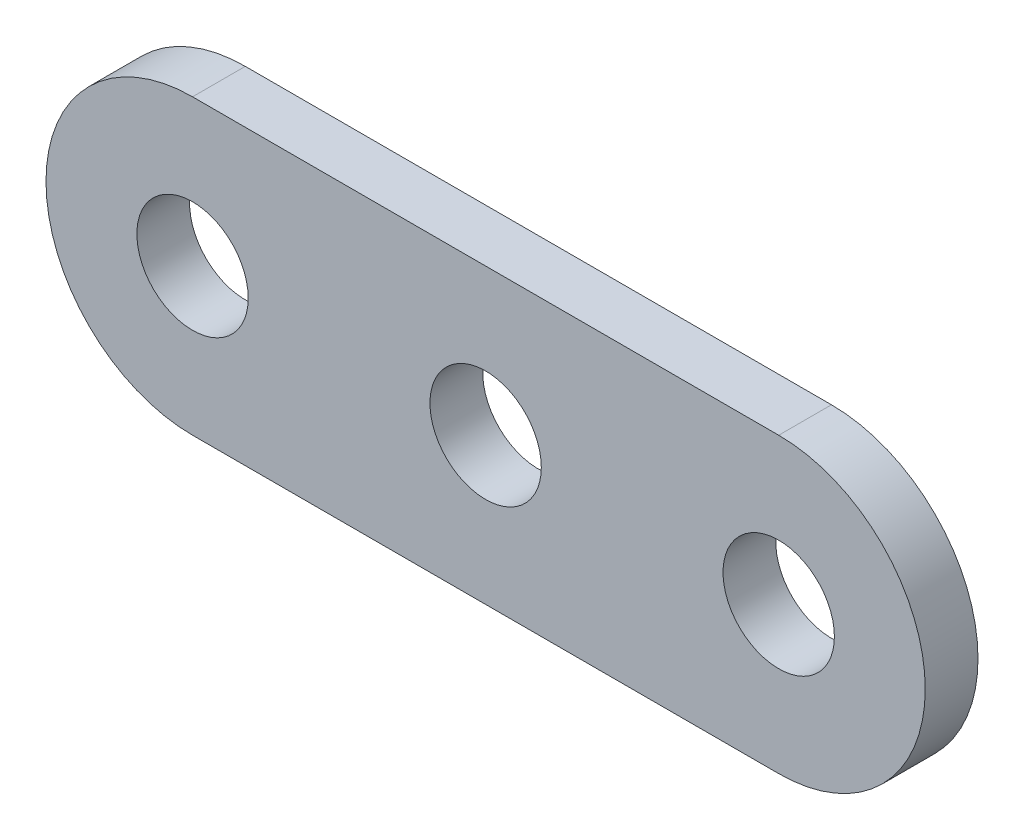
ISO-10303-21;
HEADER;
FILE_DESCRIPTION(('STEP AP214'),'2;1');
FILE_NAME('part.step','',(''),(''),'','','');
FILE_SCHEMA(('AUTOMOTIVE_DESIGN { 1 0 10303 214 1 1 1 1 }'));
ENDSEC;
DATA;
#1=APPLICATION_CONTEXT('core data for automotive mechanical design processes');
#2=APPLICATION_PROTOCOL_DEFINITION('international standard','automotive_design',2000,#1);
#3=PRODUCT_CONTEXT('',#1,'mechanical');
#4=PRODUCT('Part','Part','',(#3));
#5=PRODUCT_RELATED_PRODUCT_CATEGORY('part','',(#4));
#6=PRODUCT_DEFINITION_FORMATION('','',#4);
#7=PRODUCT_DEFINITION_CONTEXT('part definition',#1,'design');
#8=PRODUCT_DEFINITION('design','',#6,#7);
#9=PRODUCT_DEFINITION_SHAPE('','',#8);
#10=(LENGTH_UNIT() NAMED_UNIT(*) SI_UNIT(.MILLI.,.METRE.));
#11=(NAMED_UNIT(*) PLANE_ANGLE_UNIT() SI_UNIT($,.RADIAN.));
#12=(NAMED_UNIT(*) SI_UNIT($,.STERADIAN.) SOLID_ANGLE_UNIT());
#13=UNCERTAINTY_MEASURE_WITH_UNIT(LENGTH_MEASURE(1.E-05),#10,'distance_accuracy_value','');
#14=(GEOMETRIC_REPRESENTATION_CONTEXT(3) GLOBAL_UNCERTAINTY_ASSIGNED_CONTEXT((#13)) GLOBAL_UNIT_ASSIGNED_CONTEXT((#10,
#11,#12)) REPRESENTATION_CONTEXT('',''));
#15=CARTESIAN_POINT('',(0.,0.,0.));
#16=DIRECTION('',(0.,0.,1.));
#17=DIRECTION('',(1.,0.,0.));
#18=AXIS2_PLACEMENT_3D('',#15,#16,#17);
#19=CARTESIAN_POINT('',(12.7000000000047,0.,2.286));
#20=DIRECTION('',(0.,0.,1.));
#21=DIRECTION('',(1.,0.,0.));
#22=AXIS2_PLACEMENT_3D('',#19,#20,#21);
#23=PLANE('',#22);
#24=CARTESIAN_POINT('',(12.7000000000047,0.,2.286));
#25=DIRECTION('',(0.,0.,1.));
#26=DIRECTION('',(1.,0.,0.));
#27=AXIS2_PLACEMENT_3D('',#24,#25,#26);
#28=CIRCLE('',#27,2.413);
#29=CARTESIAN_POINT('',(15.1130000000047,0.,2.286));
#30=VERTEX_POINT('',#29);
#31=EDGE_CURVE('E122',#30,#30,#28,.T.);
#32=ORIENTED_EDGE('',*,*,#31,.F.);
#33=EDGE_LOOP('',(#32));
#34=FACE_BOUND('',#33,.T.);
#35=CARTESIAN_POINT('',(12.7000000000047,0.,2.286));
#36=DIRECTION('',(0.,0.,1.));
#37=DIRECTION('',(1.,0.,0.));
#38=AXIS2_PLACEMENT_3D('',#35,#36,#37);
#39=CIRCLE('',#38,6.35);
#40=CARTESIAN_POINT('',(12.7000000000047,-6.35,2.286));
#41=VERTEX_POINT('',#40);
#42=CARTESIAN_POINT('',(12.7000000000047,6.35,2.286));
#43=VERTEX_POINT('',#42);
#44=EDGE_CURVE('E92',#41,#43,#39,.T.);
#45=ORIENTED_EDGE('',*,*,#44,.T.);
#46=DIRECTION('',(-1.,0.,0.));
#47=VECTOR('',#46,1.);
#48=CARTESIAN_POINT('',(-12.7000000000047,6.35,2.286));
#49=LINE('',#48,#47);
#50=CARTESIAN_POINT('',(-12.7000000000047,6.35,2.286));
#51=VERTEX_POINT('',#50);
#52=EDGE_CURVE('E87',#43,#51,#49,.T.);
#53=ORIENTED_EDGE('',*,*,#52,.T.);
#54=CARTESIAN_POINT('',(-12.7000000000047,0.,2.286));
#55=DIRECTION('',(0.,0.,1.));
#56=DIRECTION('',(-1.,0.,0.));
#57=AXIS2_PLACEMENT_3D('',#54,#55,#56);
#58=CIRCLE('',#57,6.35);
#59=CARTESIAN_POINT('',(-12.7000000000047,-6.35,2.286));
#60=VERTEX_POINT('',#59);
#61=EDGE_CURVE('E90',#51,#60,#58,.T.);
#62=ORIENTED_EDGE('',*,*,#61,.T.);
#63=DIRECTION('',(1.,0.,0.));
#64=VECTOR('',#63,1.);
#65=CARTESIAN_POINT('',(-12.7000000000047,-6.35,2.286));
#66=LINE('',#65,#64);
#67=EDGE_CURVE('E57',#60,#41,#66,.T.);
#68=ORIENTED_EDGE('',*,*,#67,.T.);
#69=EDGE_LOOP('',(#45,#53,#62,#68));
#70=FACE_BOUND('',#69,.T.);
#71=CARTESIAN_POINT('',(0.,0.,2.286));
#72=DIRECTION('',(0.,0.,1.));
#73=DIRECTION('',(1.,0.,0.));
#74=AXIS2_PLACEMENT_3D('',#71,#72,#73);
#75=CIRCLE('',#74,2.413);
#76=CARTESIAN_POINT('',(2.413,0.,2.286));
#77=VERTEX_POINT('',#76);
#78=EDGE_CURVE('E107',#77,#77,#75,.T.);
#79=ORIENTED_EDGE('',*,*,#78,.F.);
#80=EDGE_LOOP('',(#79));
#81=FACE_BOUND('',#80,.T.);
#82=CARTESIAN_POINT('',(-12.7000000000047,0.,2.286));
#83=DIRECTION('',(0.,0.,1.));
#84=DIRECTION('',(1.,0.,0.));
#85=AXIS2_PLACEMENT_3D('',#82,#83,#84);
#86=CIRCLE('',#85,2.413);
#87=CARTESIAN_POINT('',(-10.2870000000047,0.,2.286));
#88=VERTEX_POINT('',#87);
#89=EDGE_CURVE('E128',#88,#88,#86,.T.);
#90=ORIENTED_EDGE('',*,*,#89,.F.);
#91=EDGE_LOOP('',(#90));
#92=FACE_BOUND('',#91,.T.);
#93=ADVANCED_FACE('F40',(#34,#70,#81,#92),#23,.T.);
#94=CARTESIAN_POINT('',(12.7000000000047,0.,0.));
#95=DIRECTION('',(0.,0.,1.));
#96=DIRECTION('',(1.,0.,0.));
#97=AXIS2_PLACEMENT_3D('',#94,#95,#96);
#98=PLANE('',#97);
#99=CARTESIAN_POINT('',(12.7000000000047,0.,0.));
#100=DIRECTION('',(0.,0.,1.));
#101=DIRECTION('',(1.,0.,0.));
#102=AXIS2_PLACEMENT_3D('',#99,#100,#101);
#103=CIRCLE('',#102,2.413);
#104=CARTESIAN_POINT('',(15.1130000000047,0.,0.));
#105=VERTEX_POINT('',#104);
#106=EDGE_CURVE('E125',#105,#105,#103,.T.);
#107=ORIENTED_EDGE('',*,*,#106,.T.);
#108=EDGE_LOOP('',(#107));
#109=FACE_BOUND('',#108,.T.);
#110=CARTESIAN_POINT('',(12.7000000000047,0.,0.));
#111=DIRECTION('',(0.,0.,1.));
#112=DIRECTION('',(1.,0.,0.));
#113=AXIS2_PLACEMENT_3D('',#110,#111,#112);
#114=CIRCLE('',#113,6.35);
#115=CARTESIAN_POINT('',(12.7000000000047,-6.35,0.));
#116=VERTEX_POINT('',#115);
#117=CARTESIAN_POINT('',(12.7000000000047,6.35,0.));
#118=VERTEX_POINT('',#117);
#119=EDGE_CURVE('E104',#116,#118,#114,.T.);
#120=ORIENTED_EDGE('',*,*,#119,.F.);
#121=DIRECTION('',(1.,0.,0.));
#122=VECTOR('',#121,1.);
#123=CARTESIAN_POINT('',(-12.7000000000047,-6.35,0.));
#124=LINE('',#123,#122);
#125=CARTESIAN_POINT('',(-12.7000000000047,-6.35,0.));
#126=VERTEX_POINT('',#125);
#127=EDGE_CURVE('E80',#126,#116,#124,.T.);
#128=ORIENTED_EDGE('',*,*,#127,.F.);
#129=CARTESIAN_POINT('',(-12.7000000000047,0.,0.));
#130=DIRECTION('',(0.,0.,1.));
#131=DIRECTION('',(-1.,0.,0.));
#132=AXIS2_PLACEMENT_3D('',#129,#130,#131);
#133=CIRCLE('',#132,6.35);
#134=CARTESIAN_POINT('',(-12.7000000000047,6.35,0.));
#135=VERTEX_POINT('',#134);
#136=EDGE_CURVE('E74',#135,#126,#133,.T.);
#137=ORIENTED_EDGE('',*,*,#136,.F.);
#138=DIRECTION('',(-1.,0.,0.));
#139=VECTOR('',#138,1.);
#140=CARTESIAN_POINT('',(-12.7000000000047,6.35,0.));
#141=LINE('',#140,#139);
#142=EDGE_CURVE('E96',#118,#135,#141,.T.);
#143=ORIENTED_EDGE('',*,*,#142,.F.);
#144=EDGE_LOOP('',(#120,#128,#137,#143));
#145=FACE_BOUND('',#144,.T.);
#146=CARTESIAN_POINT('',(0.,0.,0.));
#147=DIRECTION('',(0.,0.,1.));
#148=DIRECTION('',(1.,0.,0.));
#149=AXIS2_PLACEMENT_3D('',#146,#147,#148);
#150=CIRCLE('',#149,2.413);
#151=CARTESIAN_POINT('',(2.413,0.,0.));
#152=VERTEX_POINT('',#151);
#153=EDGE_CURVE('E119',#152,#152,#150,.T.);
#154=ORIENTED_EDGE('',*,*,#153,.T.);
#155=EDGE_LOOP('',(#154));
#156=FACE_BOUND('',#155,.T.);
#157=CARTESIAN_POINT('',(-12.7000000000047,0.,0.));
#158=DIRECTION('',(0.,0.,1.));
#159=DIRECTION('',(1.,0.,0.));
#160=AXIS2_PLACEMENT_3D('',#157,#158,#159);
#161=CIRCLE('',#160,2.413);
#162=CARTESIAN_POINT('',(-10.2870000000047,0.,0.));
#163=VERTEX_POINT('',#162);
#164=EDGE_CURVE('E131',#163,#163,#161,.T.);
#165=ORIENTED_EDGE('',*,*,#164,.T.);
#166=EDGE_LOOP('',(#165));
#167=FACE_BOUND('',#166,.T.);
#168=ADVANCED_FACE('F115',(#109,#145,#156,#167),#98,.F.);
#169=CARTESIAN_POINT('',(12.7000000000047,0.,2.286));
#170=DIRECTION('',(0.,0.,-1.));
#171=DIRECTION('',(-1.,0.,0.));
#172=AXIS2_PLACEMENT_3D('',#169,#170,#171);
#173=CYLINDRICAL_SURFACE('',#172,6.35);
#174=ORIENTED_EDGE('',*,*,#119,.T.);
#175=DIRECTION('',(0.,0.,-1.));
#176=VECTOR('',#175,1.);
#177=CARTESIAN_POINT('',(12.7000000000047,6.35,2.286));
#178=LINE('',#177,#176);
#179=EDGE_CURVE('E13',#43,#118,#178,.T.);
#180=ORIENTED_EDGE('',*,*,#179,.F.);
#181=ORIENTED_EDGE('',*,*,#44,.F.);
#182=DIRECTION('',(0.,0.,-1.));
#183=VECTOR('',#182,1.);
#184=CARTESIAN_POINT('',(12.7000000000047,-6.35,2.286));
#185=LINE('',#184,#183);
#186=EDGE_CURVE('E100',#41,#116,#185,.T.);
#187=ORIENTED_EDGE('',*,*,#186,.T.);
#188=EDGE_LOOP('',(#174,#180,#181,#187));
#189=FACE_BOUND('',#188,.T.);
#190=ADVANCED_FACE('F42',(#189),#173,.T.);
#191=CARTESIAN_POINT('',(-12.7000000000047,6.35,2.286));
#192=DIRECTION('',(0.,-1.,0.));
#193=DIRECTION('',(0.,0.,-1.));
#194=AXIS2_PLACEMENT_3D('',#191,#192,#193);
#195=PLANE('',#194);
#196=ORIENTED_EDGE('',*,*,#142,.T.);
#197=DIRECTION('',(0.,0.,-1.));
#198=VECTOR('',#197,1.);
#199=CARTESIAN_POINT('',(-12.7000000000047,6.35,2.286));
#200=LINE('',#199,#198);
#201=EDGE_CURVE('E49',#51,#135,#200,.T.);
#202=ORIENTED_EDGE('',*,*,#201,.F.);
#203=ORIENTED_EDGE('',*,*,#52,.F.);
#204=ORIENTED_EDGE('',*,*,#179,.T.);
#205=EDGE_LOOP('',(#196,#202,#203,#204));
#206=FACE_BOUND('',#205,.T.);
#207=ADVANCED_FACE('F95',(#206),#195,.F.);
#208=CARTESIAN_POINT('',(-12.7000000000047,0.,2.286));
#209=DIRECTION('',(0.,0.,-1.));
#210=DIRECTION('',(-1.,0.,0.));
#211=AXIS2_PLACEMENT_3D('',#208,#209,#210);
#212=CYLINDRICAL_SURFACE('',#211,6.35);
#213=ORIENTED_EDGE('',*,*,#136,.T.);
#214=DIRECTION('',(0.,0.,-1.));
#215=VECTOR('',#214,1.);
#216=CARTESIAN_POINT('',(-12.7000000000047,-6.35,2.286));
#217=LINE('',#216,#215);
#218=EDGE_CURVE('E97',#60,#126,#217,.T.);
#219=ORIENTED_EDGE('',*,*,#218,.F.);
#220=ORIENTED_EDGE('',*,*,#61,.F.);
#221=ORIENTED_EDGE('',*,*,#201,.T.);
#222=EDGE_LOOP('',(#213,#219,#220,#221));
#223=FACE_BOUND('',#222,.T.);
#224=ADVANCED_FACE('F98',(#223),#212,.T.);
#225=CARTESIAN_POINT('',(-12.7000000000047,-6.35,2.286));
#226=DIRECTION('',(0.,1.,0.));
#227=DIRECTION('',(0.,0.,1.));
#228=AXIS2_PLACEMENT_3D('',#225,#226,#227);
#229=PLANE('',#228);
#230=ORIENTED_EDGE('',*,*,#127,.T.);
#231=ORIENTED_EDGE('',*,*,#186,.F.);
#232=ORIENTED_EDGE('',*,*,#67,.F.);
#233=ORIENTED_EDGE('',*,*,#218,.T.);
#234=EDGE_LOOP('',(#230,#231,#232,#233));
#235=FACE_BOUND('',#234,.T.);
#236=ADVANCED_FACE('F112',(#235),#229,.F.);
#237=CARTESIAN_POINT('',(0.,0.,2.286));
#238=DIRECTION('',(0.,0.,-1.));
#239=DIRECTION('',(-1.,0.,0.));
#240=AXIS2_PLACEMENT_3D('',#237,#238,#239);
#241=CYLINDRICAL_SURFACE('',#240,2.413);
#242=ORIENTED_EDGE('',*,*,#78,.T.);
#243=EDGE_LOOP('',(#242));
#244=FACE_BOUND('',#243,.T.);
#245=ORIENTED_EDGE('',*,*,#153,.F.);
#246=EDGE_LOOP('',(#245));
#247=FACE_BOUND('',#246,.T.);
#248=ADVANCED_FACE('F150',(#244,#247),#241,.F.);
#249=CARTESIAN_POINT('',(12.7000000000047,0.,2.286));
#250=DIRECTION('',(0.,0.,-1.));
#251=DIRECTION('',(-1.,0.,0.));
#252=AXIS2_PLACEMENT_3D('',#249,#250,#251);
#253=CYLINDRICAL_SURFACE('',#252,2.413);
#254=ORIENTED_EDGE('',*,*,#31,.T.);
#255=EDGE_LOOP('',(#254));
#256=FACE_BOUND('',#255,.T.);
#257=ORIENTED_EDGE('',*,*,#106,.F.);
#258=EDGE_LOOP('',(#257));
#259=FACE_BOUND('',#258,.T.);
#260=ADVANCED_FACE('F196',(#256,#259),#253,.F.);
#261=CARTESIAN_POINT('',(-12.7000000000047,0.,2.286));
#262=DIRECTION('',(0.,0.,-1.));
#263=DIRECTION('',(-1.,0.,0.));
#264=AXIS2_PLACEMENT_3D('',#261,#262,#263);
#265=CYLINDRICAL_SURFACE('',#264,2.413);
#266=ORIENTED_EDGE('',*,*,#89,.T.);
#267=EDGE_LOOP('',(#266));
#268=FACE_BOUND('',#267,.T.);
#269=ORIENTED_EDGE('',*,*,#164,.F.);
#270=EDGE_LOOP('',(#269));
#271=FACE_BOUND('',#270,.T.);
#272=ADVANCED_FACE('F137',(#268,#271),#265,.F.);
#273=CLOSED_SHELL('',(#93,#168,#190,#207,#224,#236,#248,#260,#272));
#274=MANIFOLD_SOLID_BREP('B2',#273);
#275=ADVANCED_BREP_SHAPE_REPRESENTATION('',(#18,#274),#14);
#276=SHAPE_DEFINITION_REPRESENTATION(#9,#275);
ENDSEC;
END-ISO-10303-21;
